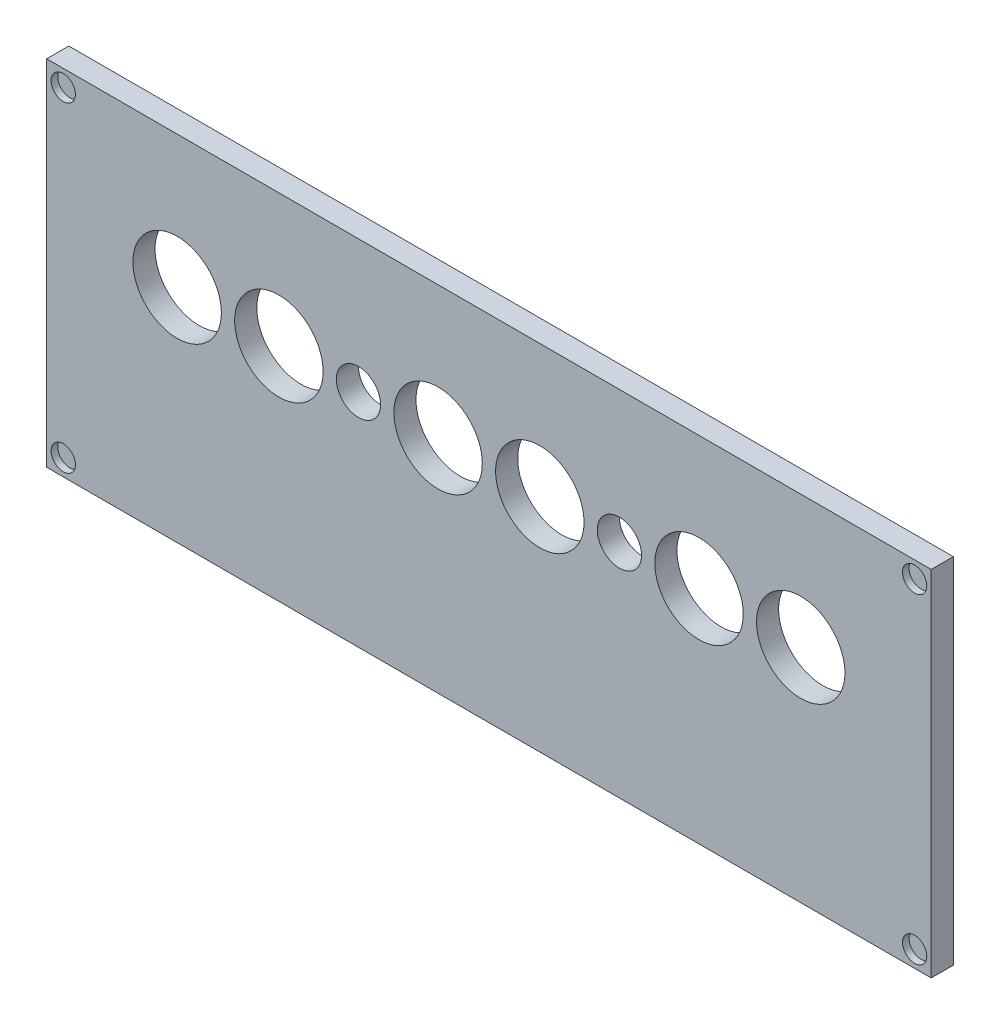
ISO-10303-21;
HEADER;
FILE_DESCRIPTION(('STEP AP214'),'2;1');
FILE_NAME('part.step','',(''),(''),'','','');
FILE_SCHEMA(('AUTOMOTIVE_DESIGN { 1 0 10303 214 1 1 1 1 }'));
ENDSEC;
DATA;
#1=APPLICATION_CONTEXT('core data for automotive mechanical design processes');
#2=APPLICATION_PROTOCOL_DEFINITION('international standard','automotive_design',2000,#1);
#3=PRODUCT_CONTEXT('',#1,'mechanical');
#4=PRODUCT('Part','Part','',(#3));
#5=PRODUCT_RELATED_PRODUCT_CATEGORY('part','',(#4));
#6=PRODUCT_DEFINITION_FORMATION('','',#4);
#7=PRODUCT_DEFINITION_CONTEXT('part definition',#1,'design');
#8=PRODUCT_DEFINITION('design','',#6,#7);
#9=PRODUCT_DEFINITION_SHAPE('','',#8);
#10=(LENGTH_UNIT() NAMED_UNIT(*) SI_UNIT(.MILLI.,.METRE.));
#11=(NAMED_UNIT(*) PLANE_ANGLE_UNIT() SI_UNIT($,.RADIAN.));
#12=(NAMED_UNIT(*) SI_UNIT($,.STERADIAN.) SOLID_ANGLE_UNIT());
#13=UNCERTAINTY_MEASURE_WITH_UNIT(LENGTH_MEASURE(1.E-05),#10,'distance_accuracy_value','');
#14=(GEOMETRIC_REPRESENTATION_CONTEXT(3) GLOBAL_UNCERTAINTY_ASSIGNED_CONTEXT((#13)) GLOBAL_UNIT_ASSIGNED_CONTEXT((#10,
#11,#12)) REPRESENTATION_CONTEXT('',''));
#15=CARTESIAN_POINT('',(0.,0.,0.));
#16=DIRECTION('',(0.,0.,1.));
#17=DIRECTION('',(1.,0.,0.));
#18=AXIS2_PLACEMENT_3D('',#15,#16,#17);
#19=CARTESIAN_POINT('',(100.,-40.,5.));
#20=DIRECTION('',(-1.,0.,0.));
#21=DIRECTION('',(0.,0.,1.));
#22=AXIS2_PLACEMENT_3D('',#19,#20,#21);
#23=PLANE('',#22);
#24=DIRECTION('',(0.,1.,0.));
#25=VECTOR('',#24,1.);
#26=CARTESIAN_POINT('',(100.,-40.,0.));
#27=LINE('',#26,#25);
#28=CARTESIAN_POINT('',(100.,-40.,0.));
#29=VERTEX_POINT('',#28);
#30=CARTESIAN_POINT('',(100.,40.,0.));
#31=VERTEX_POINT('',#30);
#32=EDGE_CURVE('E100',#29,#31,#27,.T.);
#33=ORIENTED_EDGE('',*,*,#32,.T.);
#34=DIRECTION('',(0.,0.,-1.));
#35=VECTOR('',#34,1.);
#36=CARTESIAN_POINT('',(100.,40.,5.));
#37=LINE('',#36,#35);
#38=CARTESIAN_POINT('',(100.,40.,5.));
#39=VERTEX_POINT('',#38);
#40=EDGE_CURVE('E11',#39,#31,#37,.T.);
#41=ORIENTED_EDGE('',*,*,#40,.F.);
#42=DIRECTION('',(0.,1.,0.));
#43=VECTOR('',#42,1.);
#44=CARTESIAN_POINT('',(100.,-40.,5.));
#45=LINE('',#44,#43);
#46=CARTESIAN_POINT('',(100.,-40.,5.));
#47=VERTEX_POINT('',#46);
#48=EDGE_CURVE('E88',#47,#39,#45,.T.);
#49=ORIENTED_EDGE('',*,*,#48,.F.);
#50=DIRECTION('',(0.,0.,-1.));
#51=VECTOR('',#50,1.);
#52=CARTESIAN_POINT('',(100.,-40.,5.));
#53=LINE('',#52,#51);
#54=EDGE_CURVE('E96',#47,#29,#53,.T.);
#55=ORIENTED_EDGE('',*,*,#54,.T.);
#56=EDGE_LOOP('',(#33,#41,#49,#55));
#57=FACE_BOUND('',#56,.T.);
#58=ADVANCED_FACE('F37',(#57),#23,.F.);
#59=CARTESIAN_POINT('',(-100.,40.,5.));
#60=DIRECTION('',(0.,-1.,0.));
#61=DIRECTION('',(0.,0.,-1.));
#62=AXIS2_PLACEMENT_3D('',#59,#60,#61);
#63=PLANE('',#62);
#64=DIRECTION('',(-1.,0.,0.));
#65=VECTOR('',#64,1.);
#66=CARTESIAN_POINT('',(-100.,40.,0.));
#67=LINE('',#66,#65);
#68=CARTESIAN_POINT('',(-100.,40.,0.));
#69=VERTEX_POINT('',#68);
#70=EDGE_CURVE('E92',#31,#69,#67,.T.);
#71=ORIENTED_EDGE('',*,*,#70,.T.);
#72=DIRECTION('',(0.,0.,-1.));
#73=VECTOR('',#72,1.);
#74=CARTESIAN_POINT('',(-100.,40.,5.));
#75=LINE('',#74,#73);
#76=CARTESIAN_POINT('',(-100.,40.,5.));
#77=VERTEX_POINT('',#76);
#78=EDGE_CURVE('E45',#77,#69,#75,.T.);
#79=ORIENTED_EDGE('',*,*,#78,.F.);
#80=DIRECTION('',(-1.,0.,0.));
#81=VECTOR('',#80,1.);
#82=CARTESIAN_POINT('',(-100.,40.,5.));
#83=LINE('',#82,#81);
#84=EDGE_CURVE('E83',#39,#77,#83,.T.);
#85=ORIENTED_EDGE('',*,*,#84,.F.);
#86=ORIENTED_EDGE('',*,*,#40,.T.);
#87=EDGE_LOOP('',(#71,#79,#85,#86));
#88=FACE_BOUND('',#87,.T.);
#89=ADVANCED_FACE('F91',(#88),#63,.F.);
#90=CARTESIAN_POINT('',(-100.,-40.,5.));
#91=DIRECTION('',(1.,0.,0.));
#92=DIRECTION('',(0.,0.,-1.));
#93=AXIS2_PLACEMENT_3D('',#90,#91,#92);
#94=PLANE('',#93);
#95=DIRECTION('',(0.,-1.,0.));
#96=VECTOR('',#95,1.);
#97=CARTESIAN_POINT('',(-100.,-40.,0.));
#98=LINE('',#97,#96);
#99=CARTESIAN_POINT('',(-100.,-40.,0.));
#100=VERTEX_POINT('',#99);
#101=EDGE_CURVE('E70',#69,#100,#98,.T.);
#102=ORIENTED_EDGE('',*,*,#101,.T.);
#103=DIRECTION('',(0.,0.,-1.));
#104=VECTOR('',#103,1.);
#105=CARTESIAN_POINT('',(-100.,-40.,5.));
#106=LINE('',#105,#104);
#107=CARTESIAN_POINT('',(-100.,-40.,5.));
#108=VERTEX_POINT('',#107);
#109=EDGE_CURVE('E93',#108,#100,#106,.T.);
#110=ORIENTED_EDGE('',*,*,#109,.F.);
#111=DIRECTION('',(0.,-1.,0.));
#112=VECTOR('',#111,1.);
#113=CARTESIAN_POINT('',(-100.,-40.,5.));
#114=LINE('',#113,#112);
#115=EDGE_CURVE('E86',#77,#108,#114,.T.);
#116=ORIENTED_EDGE('',*,*,#115,.F.);
#117=ORIENTED_EDGE('',*,*,#78,.T.);
#118=EDGE_LOOP('',(#102,#110,#116,#117));
#119=FACE_BOUND('',#118,.T.);
#120=ADVANCED_FACE('F94',(#119),#94,.F.);
#121=CARTESIAN_POINT('',(-100.,-40.,5.));
#122=DIRECTION('',(0.,1.,0.));
#123=DIRECTION('',(0.,0.,1.));
#124=AXIS2_PLACEMENT_3D('',#121,#122,#123);
#125=PLANE('',#124);
#126=DIRECTION('',(1.,0.,0.));
#127=VECTOR('',#126,1.);
#128=CARTESIAN_POINT('',(-100.,-40.,0.));
#129=LINE('',#128,#127);
#130=EDGE_CURVE('E76',#100,#29,#129,.T.);
#131=ORIENTED_EDGE('',*,*,#130,.T.);
#132=ORIENTED_EDGE('',*,*,#54,.F.);
#133=DIRECTION('',(1.,0.,0.));
#134=VECTOR('',#133,1.);
#135=CARTESIAN_POINT('',(-100.,-40.,5.));
#136=LINE('',#135,#134);
#137=EDGE_CURVE('E53',#108,#47,#136,.T.);
#138=ORIENTED_EDGE('',*,*,#137,.F.);
#139=ORIENTED_EDGE('',*,*,#109,.T.);
#140=EDGE_LOOP('',(#131,#132,#138,#139));
#141=FACE_BOUND('',#140,.T.);
#142=ADVANCED_FACE('F108',(#141),#125,.F.);
#143=CARTESIAN_POINT('',(0.,0.,5.));
#144=DIRECTION('',(0.,0.,-1.));
#145=DIRECTION('',(-1.,0.,0.));
#146=AXIS2_PLACEMENT_3D('',#143,#144,#145);
#147=PLANE('',#146);
#148=CARTESIAN_POINT('',(70.5,10.,5.));
#149=DIRECTION('',(0.,0.,1.));
#150=DIRECTION('',(1.,0.,0.));
#151=AXIS2_PLACEMENT_3D('',#148,#149,#150);
#152=CIRCLE('',#151,9.99999999999998);
#153=CARTESIAN_POINT('',(80.5,10.,5.));
#154=VERTEX_POINT('',#153);
#155=EDGE_CURVE('E180',#154,#154,#152,.T.);
#156=ORIENTED_EDGE('',*,*,#155,.F.);
#157=EDGE_LOOP('',(#156));
#158=FACE_BOUND('',#157,.T.);
#159=CARTESIAN_POINT('',(47.5,10.,5.));
#160=DIRECTION('',(0.,0.,1.));
#161=DIRECTION('',(1.,0.,0.));
#162=AXIS2_PLACEMENT_3D('',#159,#160,#161);
#163=CIRCLE('',#162,9.99999999999999);
#164=CARTESIAN_POINT('',(57.5,10.,5.));
#165=VERTEX_POINT('',#164);
#166=EDGE_CURVE('E174',#165,#165,#163,.T.);
#167=ORIENTED_EDGE('',*,*,#166,.F.);
#168=EDGE_LOOP('',(#167));
#169=FACE_BOUND('',#168,.T.);
#170=CARTESIAN_POINT('',(29.5,10.,5.));
#171=DIRECTION('',(0.,0.,1.));
#172=DIRECTION('',(1.,0.,0.));
#173=AXIS2_PLACEMENT_3D('',#170,#171,#172);
#174=CIRCLE('',#173,5.);
#175=CARTESIAN_POINT('',(34.5,10.,5.));
#176=VERTEX_POINT('',#175);
#177=EDGE_CURVE('E168',#176,#176,#174,.T.);
#178=ORIENTED_EDGE('',*,*,#177,.F.);
#179=EDGE_LOOP('',(#178));
#180=FACE_BOUND('',#179,.T.);
#181=CARTESIAN_POINT('',(11.5,10.,5.));
#182=DIRECTION('',(0.,0.,1.));
#183=DIRECTION('',(1.,0.,0.));
#184=AXIS2_PLACEMENT_3D('',#181,#182,#183);
#185=CIRCLE('',#184,10.);
#186=CARTESIAN_POINT('',(21.5,10.,5.));
#187=VERTEX_POINT('',#186);
#188=EDGE_CURVE('E162',#187,#187,#185,.T.);
#189=ORIENTED_EDGE('',*,*,#188,.F.);
#190=EDGE_LOOP('',(#189));
#191=FACE_BOUND('',#190,.T.);
#192=CARTESIAN_POINT('',(-11.5,10.,5.));
#193=DIRECTION('',(0.,0.,1.));
#194=DIRECTION('',(1.,0.,0.));
#195=AXIS2_PLACEMENT_3D('',#192,#193,#194);
#196=CIRCLE('',#195,10.);
#197=CARTESIAN_POINT('',(-1.50000000000002,10.,5.));
#198=VERTEX_POINT('',#197);
#199=EDGE_CURVE('E156',#198,#198,#196,.T.);
#200=ORIENTED_EDGE('',*,*,#199,.F.);
#201=EDGE_LOOP('',(#200));
#202=FACE_BOUND('',#201,.T.);
#203=CARTESIAN_POINT('',(-29.5,10.,5.));
#204=DIRECTION('',(0.,0.,1.));
#205=DIRECTION('',(1.,0.,0.));
#206=AXIS2_PLACEMENT_3D('',#203,#204,#205);
#207=CIRCLE('',#206,5.);
#208=CARTESIAN_POINT('',(-24.5,10.,5.));
#209=VERTEX_POINT('',#208);
#210=EDGE_CURVE('E150',#209,#209,#207,.T.);
#211=ORIENTED_EDGE('',*,*,#210,.F.);
#212=EDGE_LOOP('',(#211));
#213=FACE_BOUND('',#212,.T.);
#214=CARTESIAN_POINT('',(-47.5,10.,5.));
#215=DIRECTION('',(0.,0.,1.));
#216=DIRECTION('',(1.,0.,0.));
#217=AXIS2_PLACEMENT_3D('',#214,#215,#216);
#218=CIRCLE('',#217,10.);
#219=CARTESIAN_POINT('',(-37.5,10.,5.));
#220=VERTEX_POINT('',#219);
#221=EDGE_CURVE('E144',#220,#220,#218,.T.);
#222=ORIENTED_EDGE('',*,*,#221,.F.);
#223=EDGE_LOOP('',(#222));
#224=FACE_BOUND('',#223,.T.);
#225=CARTESIAN_POINT('',(-70.5,10.,5.));
#226=DIRECTION('',(0.,0.,1.));
#227=DIRECTION('',(1.,0.,0.));
#228=AXIS2_PLACEMENT_3D('',#225,#226,#227);
#229=CIRCLE('',#228,9.99999999999999);
#230=CARTESIAN_POINT('',(-60.5,10.,5.));
#231=VERTEX_POINT('',#230);
#232=EDGE_CURVE('E138',#231,#231,#229,.T.);
#233=ORIENTED_EDGE('',*,*,#232,.F.);
#234=EDGE_LOOP('',(#233));
#235=FACE_BOUND('',#234,.T.);
#236=CARTESIAN_POINT('',(96.25,36.2500000000027,5.));
#237=DIRECTION('',(0.,0.,1.));
#238=DIRECTION('',(1.,0.,0.));
#239=AXIS2_PLACEMENT_3D('',#236,#237,#238);
#240=CIRCLE('',#239,2.75000000000001);
#241=CARTESIAN_POINT('',(99.,36.2500000000027,5.));
#242=VERTEX_POINT('',#241);
#243=EDGE_CURVE('E129',#242,#242,#240,.T.);
#244=ORIENTED_EDGE('',*,*,#243,.F.);
#245=EDGE_LOOP('',(#244));
#246=FACE_BOUND('',#245,.T.);
#247=CARTESIAN_POINT('',(96.2500000000008,-36.2499999999973,5.));
#248=DIRECTION('',(0.,0.,1.));
#249=DIRECTION('',(1.,0.,0.));
#250=AXIS2_PLACEMENT_3D('',#247,#248,#249);
#251=CIRCLE('',#250,2.75000000000001);
#252=CARTESIAN_POINT('',(99.0000000000008,-36.2499999999973,5.));
#253=VERTEX_POINT('',#252);
#254=EDGE_CURVE('E123',#253,#253,#251,.T.);
#255=ORIENTED_EDGE('',*,*,#254,.F.);
#256=EDGE_LOOP('',(#255));
#257=FACE_BOUND('',#256,.T.);
#258=CARTESIAN_POINT('',(-96.2499999999992,-36.25,5.));
#259=DIRECTION('',(0.,0.,1.));
#260=DIRECTION('',(1.,0.,0.));
#261=AXIS2_PLACEMENT_3D('',#258,#259,#260);
#262=CIRCLE('',#261,2.75000000000001);
#263=CARTESIAN_POINT('',(-93.4999999999992,-36.25,5.));
#264=VERTEX_POINT('',#263);
#265=EDGE_CURVE('E117',#264,#264,#262,.T.);
#266=ORIENTED_EDGE('',*,*,#265,.F.);
#267=EDGE_LOOP('',(#266));
#268=FACE_BOUND('',#267,.T.);
#269=CARTESIAN_POINT('',(-96.25,36.25,5.));
#270=DIRECTION('',(0.,0.,1.));
#271=DIRECTION('',(1.,0.,0.));
#272=AXIS2_PLACEMENT_3D('',#269,#270,#271);
#273=CIRCLE('',#272,2.75000000000001);
#274=CARTESIAN_POINT('',(-93.5,36.25,5.));
#275=VERTEX_POINT('',#274);
#276=EDGE_CURVE('E114',#275,#275,#273,.T.);
#277=ORIENTED_EDGE('',*,*,#276,.F.);
#278=EDGE_LOOP('',(#277));
#279=FACE_BOUND('',#278,.T.);
#280=ORIENTED_EDGE('',*,*,#48,.T.);
#281=ORIENTED_EDGE('',*,*,#84,.T.);
#282=ORIENTED_EDGE('',*,*,#115,.T.);
#283=ORIENTED_EDGE('',*,*,#137,.T.);
#284=EDGE_LOOP('',(#280,#281,#282,#283));
#285=FACE_BOUND('',#284,.T.);
#286=ADVANCED_FACE('F84',(#158,#169,#180,#191,#202,#213,#224,#235,#246,#257,#268,#279,#285),
#147,.F.);
#287=CARTESIAN_POINT('',(0.,0.,0.));
#288=DIRECTION('',(0.,0.,-1.));
#289=DIRECTION('',(-1.,0.,0.));
#290=AXIS2_PLACEMENT_3D('',#287,#288,#289);
#291=PLANE('',#290);
#292=CARTESIAN_POINT('',(70.5,10.,0.));
#293=DIRECTION('',(0.,0.,1.));
#294=DIRECTION('',(1.,0.,0.));
#295=AXIS2_PLACEMENT_3D('',#292,#293,#294);
#296=CIRCLE('',#295,9.99999999999998);
#297=CARTESIAN_POINT('',(80.5,10.,0.));
#298=VERTEX_POINT('',#297);
#299=EDGE_CURVE('E177',#298,#298,#296,.T.);
#300=ORIENTED_EDGE('',*,*,#299,.T.);
#301=EDGE_LOOP('',(#300));
#302=FACE_BOUND('',#301,.T.);
#303=CARTESIAN_POINT('',(47.5,10.,0.));
#304=DIRECTION('',(0.,0.,1.));
#305=DIRECTION('',(1.,0.,0.));
#306=AXIS2_PLACEMENT_3D('',#303,#304,#305);
#307=CIRCLE('',#306,9.99999999999999);
#308=CARTESIAN_POINT('',(57.5,10.,0.));
#309=VERTEX_POINT('',#308);
#310=EDGE_CURVE('E171',#309,#309,#307,.T.);
#311=ORIENTED_EDGE('',*,*,#310,.T.);
#312=EDGE_LOOP('',(#311));
#313=FACE_BOUND('',#312,.T.);
#314=CARTESIAN_POINT('',(29.5,10.,0.));
#315=DIRECTION('',(0.,0.,1.));
#316=DIRECTION('',(1.,0.,0.));
#317=AXIS2_PLACEMENT_3D('',#314,#315,#316);
#318=CIRCLE('',#317,5.);
#319=CARTESIAN_POINT('',(34.5,10.,0.));
#320=VERTEX_POINT('',#319);
#321=EDGE_CURVE('E165',#320,#320,#318,.T.);
#322=ORIENTED_EDGE('',*,*,#321,.T.);
#323=EDGE_LOOP('',(#322));
#324=FACE_BOUND('',#323,.T.);
#325=CARTESIAN_POINT('',(11.5,10.,0.));
#326=DIRECTION('',(0.,0.,1.));
#327=DIRECTION('',(1.,0.,0.));
#328=AXIS2_PLACEMENT_3D('',#325,#326,#327);
#329=CIRCLE('',#328,10.);
#330=CARTESIAN_POINT('',(21.5,10.,0.));
#331=VERTEX_POINT('',#330);
#332=EDGE_CURVE('E159',#331,#331,#329,.T.);
#333=ORIENTED_EDGE('',*,*,#332,.T.);
#334=EDGE_LOOP('',(#333));
#335=FACE_BOUND('',#334,.T.);
#336=CARTESIAN_POINT('',(-11.5,10.,0.));
#337=DIRECTION('',(0.,0.,1.));
#338=DIRECTION('',(1.,0.,0.));
#339=AXIS2_PLACEMENT_3D('',#336,#337,#338);
#340=CIRCLE('',#339,10.);
#341=CARTESIAN_POINT('',(-1.50000000000002,10.,0.));
#342=VERTEX_POINT('',#341);
#343=EDGE_CURVE('E153',#342,#342,#340,.T.);
#344=ORIENTED_EDGE('',*,*,#343,.T.);
#345=EDGE_LOOP('',(#344));
#346=FACE_BOUND('',#345,.T.);
#347=CARTESIAN_POINT('',(-29.5,10.,0.));
#348=DIRECTION('',(0.,0.,1.));
#349=DIRECTION('',(1.,0.,0.));
#350=AXIS2_PLACEMENT_3D('',#347,#348,#349);
#351=CIRCLE('',#350,5.);
#352=CARTESIAN_POINT('',(-24.5,10.,0.));
#353=VERTEX_POINT('',#352);
#354=EDGE_CURVE('E147',#353,#353,#351,.T.);
#355=ORIENTED_EDGE('',*,*,#354,.T.);
#356=EDGE_LOOP('',(#355));
#357=FACE_BOUND('',#356,.T.);
#358=CARTESIAN_POINT('',(-47.5,10.,0.));
#359=DIRECTION('',(0.,0.,1.));
#360=DIRECTION('',(1.,0.,0.));
#361=AXIS2_PLACEMENT_3D('',#358,#359,#360);
#362=CIRCLE('',#361,10.);
#363=CARTESIAN_POINT('',(-37.5,10.,0.));
#364=VERTEX_POINT('',#363);
#365=EDGE_CURVE('E141',#364,#364,#362,.T.);
#366=ORIENTED_EDGE('',*,*,#365,.T.);
#367=EDGE_LOOP('',(#366));
#368=FACE_BOUND('',#367,.T.);
#369=CARTESIAN_POINT('',(-70.5,10.,0.));
#370=DIRECTION('',(0.,0.,1.));
#371=DIRECTION('',(1.,0.,0.));
#372=AXIS2_PLACEMENT_3D('',#369,#370,#371);
#373=CIRCLE('',#372,9.99999999999999);
#374=CARTESIAN_POINT('',(-60.5,10.,0.));
#375=VERTEX_POINT('',#374);
#376=EDGE_CURVE('E135',#375,#375,#373,.T.);
#377=ORIENTED_EDGE('',*,*,#376,.T.);
#378=EDGE_LOOP('',(#377));
#379=FACE_BOUND('',#378,.T.);
#380=ORIENTED_EDGE('',*,*,#32,.F.);
#381=ORIENTED_EDGE('',*,*,#130,.F.);
#382=ORIENTED_EDGE('',*,*,#101,.F.);
#383=ORIENTED_EDGE('',*,*,#70,.F.);
#384=EDGE_LOOP('',(#380,#381,#382,#383));
#385=FACE_BOUND('',#384,.T.);
#386=ADVANCED_FACE('F111',(#302,#313,#324,#335,#346,#357,#368,#379,#385),#291,.T.);
#387=CARTESIAN_POINT('',(-96.25,36.25,3.5));
#388=DIRECTION('',(0.,0.,1.));
#389=DIRECTION('',(1.,0.,0.));
#390=AXIS2_PLACEMENT_3D('',#387,#388,#389);
#391=CYLINDRICAL_SURFACE('',#390,2.75000000000001);
#392=CARTESIAN_POINT('',(-96.25,36.25,3.5));
#393=DIRECTION('',(0.,0.,1.));
#394=DIRECTION('',(1.,0.,0.));
#395=AXIS2_PLACEMENT_3D('',#392,#393,#394);
#396=CIRCLE('',#395,2.75000000000001);
#397=CARTESIAN_POINT('',(-93.5,36.25,3.5));
#398=VERTEX_POINT('',#397);
#399=EDGE_CURVE('E103',#398,#398,#396,.T.);
#400=ORIENTED_EDGE('',*,*,#399,.F.);
#401=EDGE_LOOP('',(#400));
#402=FACE_BOUND('',#401,.T.);
#403=ORIENTED_EDGE('',*,*,#276,.T.);
#404=EDGE_LOOP('',(#403));
#405=FACE_BOUND('',#404,.T.);
#406=ADVANCED_FACE('F220',(#402,#405),#391,.F.);
#407=CARTESIAN_POINT('',(-96.25,36.25,3.5));
#408=DIRECTION('',(0.,0.,1.));
#409=DIRECTION('',(1.,0.,0.));
#410=AXIS2_PLACEMENT_3D('',#407,#408,#409);
#411=PLANE('',#410);
#412=ORIENTED_EDGE('',*,*,#399,.T.);
#413=EDGE_LOOP('',(#412));
#414=FACE_BOUND('',#413,.T.);
#415=ADVANCED_FACE('F222',(#414),#411,.T.);
#416=CARTESIAN_POINT('',(-96.2499999999992,-36.25,3.5));
#417=DIRECTION('',(0.,0.,1.));
#418=DIRECTION('',(1.,0.,0.));
#419=AXIS2_PLACEMENT_3D('',#416,#417,#418);
#420=CYLINDRICAL_SURFACE('',#419,2.75000000000001);
#421=CARTESIAN_POINT('',(-96.2499999999992,-36.25,3.5));
#422=DIRECTION('',(0.,0.,1.));
#423=DIRECTION('',(1.,0.,0.));
#424=AXIS2_PLACEMENT_3D('',#421,#422,#423);
#425=CIRCLE('',#424,2.75000000000001);
#426=CARTESIAN_POINT('',(-93.4999999999992,-36.25,3.5));
#427=VERTEX_POINT('',#426);
#428=EDGE_CURVE('E120',#427,#427,#425,.T.);
#429=ORIENTED_EDGE('',*,*,#428,.F.);
#430=EDGE_LOOP('',(#429));
#431=FACE_BOUND('',#430,.T.);
#432=ORIENTED_EDGE('',*,*,#265,.T.);
#433=EDGE_LOOP('',(#432));
#434=FACE_BOUND('',#433,.T.);
#435=ADVANCED_FACE('F229',(#431,#434),#420,.F.);
#436=CARTESIAN_POINT('',(-96.2499999999992,-36.25,3.5));
#437=DIRECTION('',(0.,0.,1.));
#438=DIRECTION('',(1.,0.,0.));
#439=AXIS2_PLACEMENT_3D('',#436,#437,#438);
#440=PLANE('',#439);
#441=ORIENTED_EDGE('',*,*,#428,.T.);
#442=EDGE_LOOP('',(#441));
#443=FACE_BOUND('',#442,.T.);
#444=ADVANCED_FACE('F353',(#443),#440,.T.);
#445=CARTESIAN_POINT('',(96.2500000000008,-36.2499999999973,3.5));
#446=DIRECTION('',(0.,0.,1.));
#447=DIRECTION('',(1.,0.,0.));
#448=AXIS2_PLACEMENT_3D('',#445,#446,#447);
#449=CYLINDRICAL_SURFACE('',#448,2.75000000000001);
#450=CARTESIAN_POINT('',(96.2500000000008,-36.2499999999973,3.5));
#451=DIRECTION('',(0.,0.,1.));
#452=DIRECTION('',(1.,0.,0.));
#453=AXIS2_PLACEMENT_3D('',#450,#451,#452);
#454=CIRCLE('',#453,2.75000000000001);
#455=CARTESIAN_POINT('',(99.0000000000008,-36.2499999999973,3.5));
#456=VERTEX_POINT('',#455);
#457=EDGE_CURVE('E126',#456,#456,#454,.T.);
#458=ORIENTED_EDGE('',*,*,#457,.F.);
#459=EDGE_LOOP('',(#458));
#460=FACE_BOUND('',#459,.T.);
#461=ORIENTED_EDGE('',*,*,#254,.T.);
#462=EDGE_LOOP('',(#461));
#463=FACE_BOUND('',#462,.T.);
#464=ADVANCED_FACE('F350',(#460,#463),#449,.F.);
#465=CARTESIAN_POINT('',(96.2500000000008,-36.2499999999973,3.5));
#466=DIRECTION('',(0.,0.,1.));
#467=DIRECTION('',(1.,0.,0.));
#468=AXIS2_PLACEMENT_3D('',#465,#466,#467);
#469=PLANE('',#468);
#470=ORIENTED_EDGE('',*,*,#457,.T.);
#471=EDGE_LOOP('',(#470));
#472=FACE_BOUND('',#471,.T.);
#473=ADVANCED_FACE('F346',(#472),#469,.T.);
#474=CARTESIAN_POINT('',(96.25,36.2500000000027,3.5));
#475=DIRECTION('',(0.,0.,1.));
#476=DIRECTION('',(1.,0.,0.));
#477=AXIS2_PLACEMENT_3D('',#474,#475,#476);
#478=CYLINDRICAL_SURFACE('',#477,2.75000000000001);
#479=CARTESIAN_POINT('',(96.25,36.2500000000027,3.5));
#480=DIRECTION('',(0.,0.,1.));
#481=DIRECTION('',(1.,0.,0.));
#482=AXIS2_PLACEMENT_3D('',#479,#480,#481);
#483=CIRCLE('',#482,2.75000000000001);
#484=CARTESIAN_POINT('',(99.,36.2500000000027,3.5));
#485=VERTEX_POINT('',#484);
#486=EDGE_CURVE('E132',#485,#485,#483,.T.);
#487=ORIENTED_EDGE('',*,*,#486,.F.);
#488=EDGE_LOOP('',(#487));
#489=FACE_BOUND('',#488,.T.);
#490=ORIENTED_EDGE('',*,*,#243,.T.);
#491=EDGE_LOOP('',(#490));
#492=FACE_BOUND('',#491,.T.);
#493=ADVANCED_FACE('F343',(#489,#492),#478,.F.);
#494=CARTESIAN_POINT('',(96.25,36.2500000000027,3.5));
#495=DIRECTION('',(0.,0.,1.));
#496=DIRECTION('',(1.,0.,0.));
#497=AXIS2_PLACEMENT_3D('',#494,#495,#496);
#498=PLANE('',#497);
#499=ORIENTED_EDGE('',*,*,#486,.T.);
#500=EDGE_LOOP('',(#499));
#501=FACE_BOUND('',#500,.T.);
#502=ADVANCED_FACE('F269',(#501),#498,.T.);
#503=CARTESIAN_POINT('',(-70.5,10.,0.));
#504=DIRECTION('',(0.,0.,1.));
#505=DIRECTION('',(1.,0.,0.));
#506=AXIS2_PLACEMENT_3D('',#503,#504,#505);
#507=CYLINDRICAL_SURFACE('',#506,9.99999999999999);
#508=ORIENTED_EDGE('',*,*,#376,.F.);
#509=EDGE_LOOP('',(#508));
#510=FACE_BOUND('',#509,.T.);
#511=ORIENTED_EDGE('',*,*,#232,.T.);
#512=EDGE_LOOP('',(#511));
#513=FACE_BOUND('',#512,.T.);
#514=ADVANCED_FACE('F263',(#510,#513),#507,.F.);
#515=CARTESIAN_POINT('',(-47.5,10.,0.));
#516=DIRECTION('',(0.,0.,1.));
#517=DIRECTION('',(1.,0.,0.));
#518=AXIS2_PLACEMENT_3D('',#515,#516,#517);
#519=CYLINDRICAL_SURFACE('',#518,10.);
#520=ORIENTED_EDGE('',*,*,#365,.F.);
#521=EDGE_LOOP('',(#520));
#522=FACE_BOUND('',#521,.T.);
#523=ORIENTED_EDGE('',*,*,#221,.T.);
#524=EDGE_LOOP('',(#523));
#525=FACE_BOUND('',#524,.T.);
#526=ADVANCED_FACE('F268',(#522,#525),#519,.F.);
#527=CARTESIAN_POINT('',(-29.5,10.,0.));
#528=DIRECTION('',(0.,0.,1.));
#529=DIRECTION('',(1.,0.,0.));
#530=AXIS2_PLACEMENT_3D('',#527,#528,#529);
#531=CYLINDRICAL_SURFACE('',#530,5.);
#532=ORIENTED_EDGE('',*,*,#354,.F.);
#533=EDGE_LOOP('',(#532));
#534=FACE_BOUND('',#533,.T.);
#535=ORIENTED_EDGE('',*,*,#210,.T.);
#536=EDGE_LOOP('',(#535));
#537=FACE_BOUND('',#536,.T.);
#538=ADVANCED_FACE('F281',(#534,#537),#531,.F.);
#539=CARTESIAN_POINT('',(-11.5,10.,0.));
#540=DIRECTION('',(0.,0.,1.));
#541=DIRECTION('',(1.,0.,0.));
#542=AXIS2_PLACEMENT_3D('',#539,#540,#541);
#543=CYLINDRICAL_SURFACE('',#542,10.);
#544=ORIENTED_EDGE('',*,*,#343,.F.);
#545=EDGE_LOOP('',(#544));
#546=FACE_BOUND('',#545,.T.);
#547=ORIENTED_EDGE('',*,*,#199,.T.);
#548=EDGE_LOOP('',(#547));
#549=FACE_BOUND('',#548,.T.);
#550=ADVANCED_FACE('F291',(#546,#549),#543,.F.);
#551=CARTESIAN_POINT('',(11.5,10.,0.));
#552=DIRECTION('',(0.,0.,1.));
#553=DIRECTION('',(1.,0.,0.));
#554=AXIS2_PLACEMENT_3D('',#551,#552,#553);
#555=CYLINDRICAL_SURFACE('',#554,10.);
#556=ORIENTED_EDGE('',*,*,#332,.F.);
#557=EDGE_LOOP('',(#556));
#558=FACE_BOUND('',#557,.T.);
#559=ORIENTED_EDGE('',*,*,#188,.T.);
#560=EDGE_LOOP('',(#559));
#561=FACE_BOUND('',#560,.T.);
#562=ADVANCED_FACE('F301',(#558,#561),#555,.F.);
#563=CARTESIAN_POINT('',(29.5,10.,0.));
#564=DIRECTION('',(0.,0.,1.));
#565=DIRECTION('',(1.,0.,0.));
#566=AXIS2_PLACEMENT_3D('',#563,#564,#565);
#567=CYLINDRICAL_SURFACE('',#566,5.);
#568=ORIENTED_EDGE('',*,*,#321,.F.);
#569=EDGE_LOOP('',(#568));
#570=FACE_BOUND('',#569,.T.);
#571=ORIENTED_EDGE('',*,*,#177,.T.);
#572=EDGE_LOOP('',(#571));
#573=FACE_BOUND('',#572,.T.);
#574=ADVANCED_FACE('F311',(#570,#573),#567,.F.);
#575=CARTESIAN_POINT('',(47.5,10.,0.));
#576=DIRECTION('',(0.,0.,1.));
#577=DIRECTION('',(1.,0.,0.));
#578=AXIS2_PLACEMENT_3D('',#575,#576,#577);
#579=CYLINDRICAL_SURFACE('',#578,9.99999999999999);
#580=ORIENTED_EDGE('',*,*,#310,.F.);
#581=EDGE_LOOP('',(#580));
#582=FACE_BOUND('',#581,.T.);
#583=ORIENTED_EDGE('',*,*,#166,.T.);
#584=EDGE_LOOP('',(#583));
#585=FACE_BOUND('',#584,.T.);
#586=ADVANCED_FACE('F191',(#582,#585),#579,.F.);
#587=CARTESIAN_POINT('',(70.5,10.,0.));
#588=DIRECTION('',(0.,0.,1.));
#589=DIRECTION('',(1.,0.,0.));
#590=AXIS2_PLACEMENT_3D('',#587,#588,#589);
#591=CYLINDRICAL_SURFACE('',#590,9.99999999999998);
#592=ORIENTED_EDGE('',*,*,#299,.F.);
#593=EDGE_LOOP('',(#592));
#594=FACE_BOUND('',#593,.T.);
#595=ORIENTED_EDGE('',*,*,#155,.T.);
#596=EDGE_LOOP('',(#595));
#597=FACE_BOUND('',#596,.T.);
#598=ADVANCED_FACE('F188',(#594,#597),#591,.F.);
#599=CLOSED_SHELL('',(#58,#89,#120,#142,#286,#386,#406,#415,#435,#444,#464,#473,#493,#502,#514,
#526,#538,#550,#562,#574,#586,#598));
#600=MANIFOLD_SOLID_BREP('B2',#599);
#601=ADVANCED_BREP_SHAPE_REPRESENTATION('',(#18,#600),#14);
#602=SHAPE_DEFINITION_REPRESENTATION(#9,#601);
ENDSEC;
END-ISO-10303-21;
